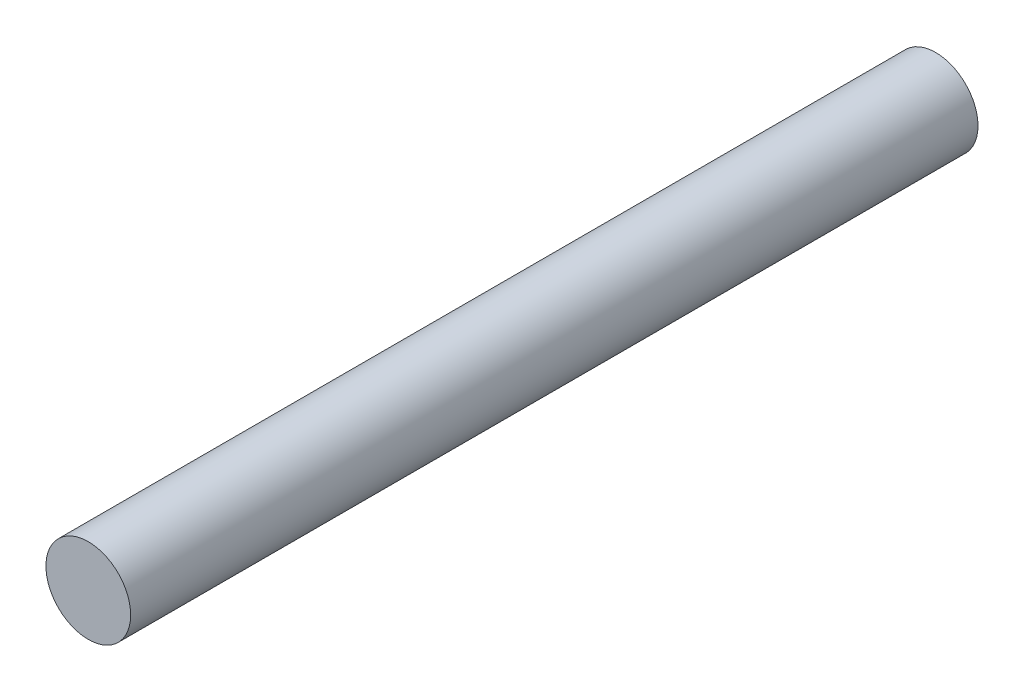
ISO-10303-21;
HEADER;
FILE_DESCRIPTION(('STEP AP214'),'2;1');
FILE_NAME('part.step','',(''),(''),'','','');
FILE_SCHEMA(('AUTOMOTIVE_DESIGN { 1 0 10303 214 1 1 1 1 }'));
ENDSEC;
DATA;
#1=APPLICATION_CONTEXT('core data for automotive mechanical design processes');
#2=APPLICATION_PROTOCOL_DEFINITION('international standard','automotive_design',2000,#1);
#3=PRODUCT_CONTEXT('',#1,'mechanical');
#4=PRODUCT('Part','Part','',(#3));
#5=PRODUCT_RELATED_PRODUCT_CATEGORY('part','',(#4));
#6=PRODUCT_DEFINITION_FORMATION('','',#4);
#7=PRODUCT_DEFINITION_CONTEXT('part definition',#1,'design');
#8=PRODUCT_DEFINITION('design','',#6,#7);
#9=PRODUCT_DEFINITION_SHAPE('','',#8);
#10=(LENGTH_UNIT() NAMED_UNIT(*) SI_UNIT(.MILLI.,.METRE.));
#11=(NAMED_UNIT(*) PLANE_ANGLE_UNIT() SI_UNIT($,.RADIAN.));
#12=(NAMED_UNIT(*) SI_UNIT($,.STERADIAN.) SOLID_ANGLE_UNIT());
#13=UNCERTAINTY_MEASURE_WITH_UNIT(LENGTH_MEASURE(1.E-05),#10,'distance_accuracy_value','');
#14=(GEOMETRIC_REPRESENTATION_CONTEXT(3) GLOBAL_UNCERTAINTY_ASSIGNED_CONTEXT((#13)) GLOBAL_UNIT_ASSIGNED_CONTEXT((#10,
#11,#12)) REPRESENTATION_CONTEXT('',''));
#15=CARTESIAN_POINT('',(0.,0.,0.));
#16=DIRECTION('',(0.,0.,1.));
#17=DIRECTION('',(1.,0.,0.));
#18=AXIS2_PLACEMENT_3D('',#15,#16,#17);
#19=CARTESIAN_POINT('',(0.,0.,63.5));
#20=DIRECTION('',(0.,0.,-1.));
#21=DIRECTION('',(-1.,0.,0.));
#22=AXIS2_PLACEMENT_3D('',#19,#20,#21);
#23=CYLINDRICAL_SURFACE('',#22,3.175);
#24=CARTESIAN_POINT('',(0.,0.,63.5));
#25=DIRECTION('',(0.,0.,1.));
#26=DIRECTION('',(1.,0.,0.));
#27=AXIS2_PLACEMENT_3D('',#24,#25,#26);
#28=CIRCLE('',#27,3.175);
#29=CARTESIAN_POINT('',(3.175,0.,63.5));
#30=VERTEX_POINT('',#29);
#31=EDGE_CURVE('E10',#30,#30,#28,.T.);
#32=ORIENTED_EDGE('',*,*,#31,.F.);
#33=EDGE_LOOP('',(#32));
#34=FACE_BOUND('',#33,.T.);
#35=CARTESIAN_POINT('',(0.,0.,0.));
#36=DIRECTION('',(0.,0.,1.));
#37=DIRECTION('',(1.,0.,0.));
#38=AXIS2_PLACEMENT_3D('',#35,#36,#37);
#39=CIRCLE('',#38,3.175);
#40=CARTESIAN_POINT('',(3.175,0.,0.));
#41=VERTEX_POINT('',#40);
#42=EDGE_CURVE('E36',#41,#41,#39,.T.);
#43=ORIENTED_EDGE('',*,*,#42,.T.);
#44=EDGE_LOOP('',(#43));
#45=FACE_BOUND('',#44,.T.);
#46=ADVANCED_FACE('F33',(#34,#45),#23,.T.);
#47=CARTESIAN_POINT('',(0.,0.,63.5));
#48=DIRECTION('',(0.,0.,1.));
#49=DIRECTION('',(1.,0.,0.));
#50=AXIS2_PLACEMENT_3D('',#47,#48,#49);
#51=PLANE('',#50);
#52=ORIENTED_EDGE('',*,*,#31,.T.);
#53=EDGE_LOOP('',(#52));
#54=FACE_BOUND('',#53,.T.);
#55=ADVANCED_FACE('F48',(#54),#51,.T.);
#56=CARTESIAN_POINT('',(0.,0.,0.));
#57=DIRECTION('',(0.,0.,1.));
#58=DIRECTION('',(1.,0.,0.));
#59=AXIS2_PLACEMENT_3D('',#56,#57,#58);
#60=PLANE('',#59);
#61=ORIENTED_EDGE('',*,*,#42,.F.);
#62=EDGE_LOOP('',(#61));
#63=FACE_BOUND('',#62,.T.);
#64=ADVANCED_FACE('F46',(#63),#60,.F.);
#65=CLOSED_SHELL('',(#46,#55,#64));
#66=MANIFOLD_SOLID_BREP('B2',#65);
#67=ADVANCED_BREP_SHAPE_REPRESENTATION('',(#18,#66),#14);
#68=SHAPE_DEFINITION_REPRESENTATION(#9,#67);
ENDSEC;
END-ISO-10303-21;
